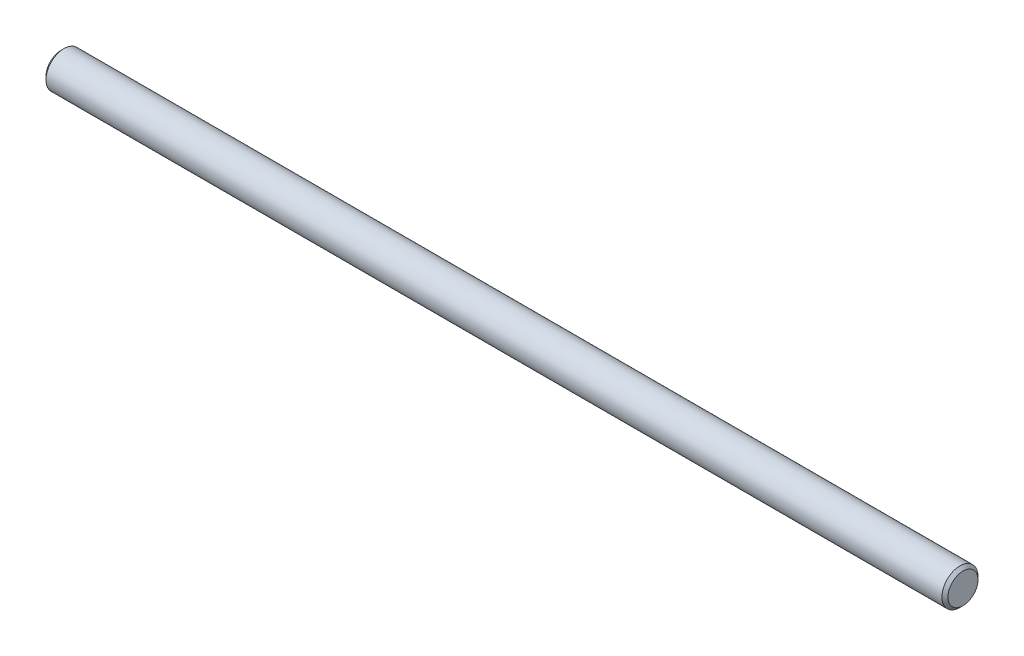
ISO-10303-21;
HEADER;
FILE_DESCRIPTION(('STEP AP214'),'2;1');
FILE_NAME('part.step','',(''),(''),'','','');
FILE_SCHEMA(('AUTOMOTIVE_DESIGN { 1 0 10303 214 1 1 1 1 }'));
ENDSEC;
DATA;
#1=APPLICATION_CONTEXT('core data for automotive mechanical design processes');
#2=APPLICATION_PROTOCOL_DEFINITION('international standard','automotive_design',2000,#1);
#3=PRODUCT_CONTEXT('',#1,'mechanical');
#4=PRODUCT('Part','Part','',(#3));
#5=PRODUCT_RELATED_PRODUCT_CATEGORY('part','',(#4));
#6=PRODUCT_DEFINITION_FORMATION('','',#4);
#7=PRODUCT_DEFINITION_CONTEXT('part definition',#1,'design');
#8=PRODUCT_DEFINITION('design','',#6,#7);
#9=PRODUCT_DEFINITION_SHAPE('','',#8);
#10=(LENGTH_UNIT() NAMED_UNIT(*) SI_UNIT(.MILLI.,.METRE.));
#11=(NAMED_UNIT(*) PLANE_ANGLE_UNIT() SI_UNIT($,.RADIAN.));
#12=(NAMED_UNIT(*) SI_UNIT($,.STERADIAN.) SOLID_ANGLE_UNIT());
#13=UNCERTAINTY_MEASURE_WITH_UNIT(LENGTH_MEASURE(1.E-05),#10,'distance_accuracy_value','');
#14=(GEOMETRIC_REPRESENTATION_CONTEXT(3) GLOBAL_UNCERTAINTY_ASSIGNED_CONTEXT((#13)) GLOBAL_UNIT_ASSIGNED_CONTEXT((#10,
#11,#12)) REPRESENTATION_CONTEXT('',''));
#15=CARTESIAN_POINT('',(0.,0.,0.));
#16=DIRECTION('',(0.,0.,1.));
#17=DIRECTION('',(1.,0.,0.));
#18=AXIS2_PLACEMENT_3D('',#15,#16,#17);
#19=CARTESIAN_POINT('',(300.,0.,0.));
#20=DIRECTION('',(-1.,0.,0.));
#21=DIRECTION('',(0.,0.,1.));
#22=AXIS2_PLACEMENT_3D('',#19,#20,#21);
#23=CYLINDRICAL_SURFACE('',#22,6.);
#24=CARTESIAN_POINT('',(299.,0.,0.));
#25=DIRECTION('',(1.,0.,0.));
#26=DIRECTION('',(0.,0.,-1.));
#27=AXIS2_PLACEMENT_3D('',#24,#25,#26);
#28=CIRCLE('',#27,6.);
#29=CARTESIAN_POINT('',(299.,0.,-6.));
#30=VERTEX_POINT('',#29);
#31=EDGE_CURVE('E44',#30,#30,#28,.F.);
#32=ORIENTED_EDGE('',*,*,#31,.T.);
#33=EDGE_LOOP('',(#32));
#34=FACE_BOUND('',#33,.T.);
#35=CARTESIAN_POINT('',(1.00000000000006,0.,0.));
#36=DIRECTION('',(1.,0.,0.));
#37=DIRECTION('',(0.,0.,-1.));
#38=AXIS2_PLACEMENT_3D('',#35,#36,#37);
#39=CIRCLE('',#38,6.);
#40=CARTESIAN_POINT('',(1.00000000000006,0.,-6.));
#41=VERTEX_POINT('',#40);
#42=EDGE_CURVE('E48',#41,#41,#39,.T.);
#43=ORIENTED_EDGE('',*,*,#42,.T.);
#44=EDGE_LOOP('',(#43));
#45=FACE_BOUND('',#44,.T.);
#46=ADVANCED_FACE('F37',(#34,#45),#23,.T.);
#47=CARTESIAN_POINT('',(300.,0.,0.));
#48=DIRECTION('',(1.,0.,0.));
#49=DIRECTION('',(0.,0.,-1.));
#50=AXIS2_PLACEMENT_3D('',#47,#48,#49);
#51=PLANE('',#50);
#52=CARTESIAN_POINT('',(300.,0.,0.));
#53=DIRECTION('',(1.,0.,0.));
#54=DIRECTION('',(0.,0.,-1.));
#55=AXIS2_PLACEMENT_3D('',#52,#53,#54);
#56=CIRCLE('',#55,4.99999999999998);
#57=CARTESIAN_POINT('',(300.,0.,-4.99999999999998));
#58=VERTEX_POINT('',#57);
#59=EDGE_CURVE('E52',#58,#58,#56,.T.);
#60=ORIENTED_EDGE('',*,*,#59,.T.);
#61=EDGE_LOOP('',(#60));
#62=FACE_BOUND('',#61,.T.);
#63=ADVANCED_FACE('F58',(#62),#51,.T.);
#64=CARTESIAN_POINT('',(0.,0.,0.));
#65=DIRECTION('',(1.,0.,0.));
#66=DIRECTION('',(0.,0.,-1.));
#67=AXIS2_PLACEMENT_3D('',#64,#65,#66);
#68=PLANE('',#67);
#69=CARTESIAN_POINT('',(0.,0.,0.));
#70=DIRECTION('',(1.,0.,0.));
#71=DIRECTION('',(0.,0.,-1.));
#72=AXIS2_PLACEMENT_3D('',#69,#70,#71);
#73=CIRCLE('',#72,4.99999999999995);
#74=CARTESIAN_POINT('',(0.,0.,-4.99999999999995));
#75=VERTEX_POINT('',#74);
#76=EDGE_CURVE('E10',#75,#75,#73,.F.);
#77=ORIENTED_EDGE('',*,*,#76,.T.);
#78=EDGE_LOOP('',(#77));
#79=FACE_BOUND('',#78,.T.);
#80=ADVANCED_FACE('F62',(#79),#68,.F.);
#81=CARTESIAN_POINT('',(300.,0.,0.));
#82=DIRECTION('',(-1.,0.,0.));
#83=DIRECTION('',(0.,0.,1.));
#84=AXIS2_PLACEMENT_3D('',#81,#82,#83);
#85=CONICAL_SURFACE('',#84,4.99999999999998,0.785398163397431);
#86=ORIENTED_EDGE('',*,*,#31,.F.);
#87=EDGE_LOOP('',(#86));
#88=FACE_BOUND('',#87,.T.);
#89=ORIENTED_EDGE('',*,*,#59,.F.);
#90=EDGE_LOOP('',(#89));
#91=FACE_BOUND('',#90,.T.);
#92=ADVANCED_FACE('F60',(#88,#91),#85,.T.);
#93=CARTESIAN_POINT('',(1.00000000000006,0.,0.));
#94=DIRECTION('',(1.,0.,0.));
#95=DIRECTION('',(0.,0.,-1.));
#96=AXIS2_PLACEMENT_3D('',#93,#94,#95);
#97=CONICAL_SURFACE('',#96,6.,0.785398163397445);
#98=ORIENTED_EDGE('',*,*,#76,.F.);
#99=EDGE_LOOP('',(#98));
#100=FACE_BOUND('',#99,.T.);
#101=ORIENTED_EDGE('',*,*,#42,.F.);
#102=EDGE_LOOP('',(#101));
#103=FACE_BOUND('',#102,.T.);
#104=ADVANCED_FACE('F39',(#100,#103),#97,.T.);
#105=CLOSED_SHELL('',(#46,#63,#80,#92,#104));
#106=MANIFOLD_SOLID_BREP('B2',#105);
#107=ADVANCED_BREP_SHAPE_REPRESENTATION('',(#18,#106),#14);
#108=SHAPE_DEFINITION_REPRESENTATION(#9,#107);
ENDSEC;
END-ISO-10303-21;
